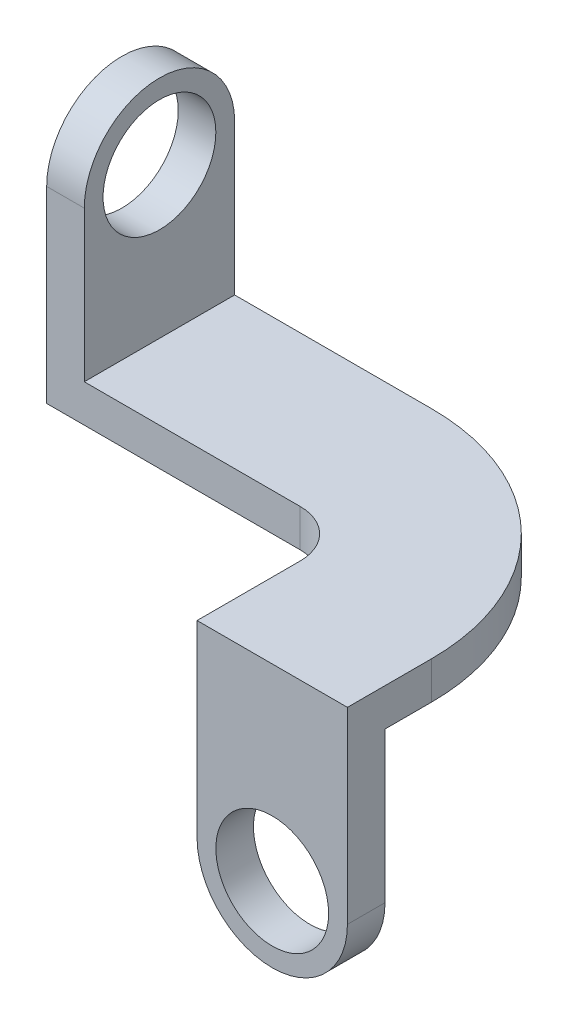
ISO-10303-21;
HEADER;
FILE_DESCRIPTION(('STEP AP214'),'2;1');
FILE_NAME('part.step','',(''),(''),'','','');
FILE_SCHEMA(('AUTOMOTIVE_DESIGN { 1 0 10303 214 1 1 1 1 }'));
ENDSEC;
DATA;
#1=APPLICATION_CONTEXT('core data for automotive mechanical design processes');
#2=APPLICATION_PROTOCOL_DEFINITION('international standard','automotive_design',2000,#1);
#3=PRODUCT_CONTEXT('',#1,'mechanical');
#4=PRODUCT('Part','Part','',(#3));
#5=PRODUCT_RELATED_PRODUCT_CATEGORY('part','',(#4));
#6=PRODUCT_DEFINITION_FORMATION('','',#4);
#7=PRODUCT_DEFINITION_CONTEXT('part definition',#1,'design');
#8=PRODUCT_DEFINITION('design','',#6,#7);
#9=PRODUCT_DEFINITION_SHAPE('','',#8);
#10=(LENGTH_UNIT() NAMED_UNIT(*) SI_UNIT(.MILLI.,.METRE.));
#11=(NAMED_UNIT(*) PLANE_ANGLE_UNIT() SI_UNIT($,.RADIAN.));
#12=(NAMED_UNIT(*) SI_UNIT($,.STERADIAN.) SOLID_ANGLE_UNIT());
#13=UNCERTAINTY_MEASURE_WITH_UNIT(LENGTH_MEASURE(1.E-05),#10,'distance_accuracy_value','');
#14=(GEOMETRIC_REPRESENTATION_CONTEXT(3) GLOBAL_UNCERTAINTY_ASSIGNED_CONTEXT((#13)) GLOBAL_UNIT_ASSIGNED_CONTEXT((#10,
#11,#12)) REPRESENTATION_CONTEXT('',''));
#15=CARTESIAN_POINT('',(0.,0.,0.));
#16=DIRECTION('',(0.,0.,1.));
#17=DIRECTION('',(1.,0.,0.));
#18=AXIS2_PLACEMENT_3D('',#15,#16,#17);
#19=CARTESIAN_POINT('',(158.496,25.4,44.704));
#20=DIRECTION('',(0.,-1.,0.));
#21=DIRECTION('',(0.,0.,-1.));
#22=AXIS2_PLACEMENT_3D('',#19,#20,#21);
#23=PLANE('',#22);
#24=DIRECTION('',(0.,0.,-1.));
#25=VECTOR('',#24,1.);
#26=CARTESIAN_POINT('',(25.4,25.4,0.));
#27=LINE('',#26,#25);
#28=CARTESIAN_POINT('',(25.4,25.4,0.));
#29=VERTEX_POINT('',#28);
#30=CARTESIAN_POINT('',(25.4,25.4,-101.6));
#31=VERTEX_POINT('',#30);
#32=EDGE_CURVE('E49',#29,#31,#27,.T.);
#33=ORIENTED_EDGE('',*,*,#32,.F.);
#34=DIRECTION('',(1.,0.,0.));
#35=VECTOR('',#34,1.);
#36=CARTESIAN_POINT('',(171.196,25.4,0.));
#37=LINE('',#36,#35);
#38=CARTESIAN_POINT('',(171.196,25.4,0.));
#39=VERTEX_POINT('',#38);
#40=EDGE_CURVE('E183',#29,#39,#37,.T.);
#41=ORIENTED_EDGE('',*,*,#40,.T.);
#42=CARTESIAN_POINT('',(171.196,25.4,32.004));
#43=DIRECTION('',(0.,-1.,0.));
#44=DIRECTION('',(0.,0.,1.));
#45=AXIS2_PLACEMENT_3D('',#42,#43,#44);
#46=CIRCLE('',#45,32.004);
#47=CARTESIAN_POINT('',(203.2,25.4,32.004));
#48=VERTEX_POINT('',#47);
#49=EDGE_CURVE('E185',#39,#48,#46,.T.);
#50=ORIENTED_EDGE('',*,*,#49,.T.);
#51=DIRECTION('',(0.,0.,1.));
#52=VECTOR('',#51,1.);
#53=CARTESIAN_POINT('',(203.2,25.4,101.6));
#54=LINE('',#53,#52);
#55=CARTESIAN_POINT('',(203.2,25.4,101.6));
#56=VERTEX_POINT('',#55);
#57=EDGE_CURVE('E193',#48,#56,#54,.T.);
#58=ORIENTED_EDGE('',*,*,#57,.T.);
#59=DIRECTION('',(1.,0.,0.));
#60=VECTOR('',#59,1.);
#61=CARTESIAN_POINT('',(304.8,25.4,101.6));
#62=LINE('',#61,#60);
#63=CARTESIAN_POINT('',(304.8,25.4,101.6));
#64=VERTEX_POINT('',#63);
#65=EDGE_CURVE('E195',#56,#64,#62,.T.);
#66=ORIENTED_EDGE('',*,*,#65,.T.);
#67=DIRECTION('',(0.,0.,-1.));
#68=VECTOR('',#67,1.);
#69=CARTESIAN_POINT('',(304.8,25.4,44.704));
#70=LINE('',#69,#68);
#71=CARTESIAN_POINT('',(304.8,25.4,44.704));
#72=VERTEX_POINT('',#71);
#73=EDGE_CURVE('E197',#64,#72,#70,.T.);
#74=ORIENTED_EDGE('',*,*,#73,.T.);
#75=CARTESIAN_POINT('',(158.496,25.4,44.704));
#76=DIRECTION('',(0.,1.,0.));
#77=DIRECTION('',(0.,0.,-1.));
#78=AXIS2_PLACEMENT_3D('',#75,#76,#77);
#79=CIRCLE('',#78,146.304);
#80=CARTESIAN_POINT('',(158.496,25.4,-101.6));
#81=VERTEX_POINT('',#80);
#82=EDGE_CURVE('E199',#72,#81,#79,.T.);
#83=ORIENTED_EDGE('',*,*,#82,.T.);
#84=DIRECTION('',(-1.,0.,0.));
#85=VECTOR('',#84,1.);
#86=CARTESIAN_POINT('',(0.,25.4,-101.6));
#87=LINE('',#86,#85);
#88=EDGE_CURVE('E163',#81,#31,#87,.T.);
#89=ORIENTED_EDGE('',*,*,#88,.T.);
#90=EDGE_LOOP('',(#33,#41,#50,#58,#66,#74,#83,#89));
#91=FACE_BOUND('',#90,.T.);
#92=ADVANCED_FACE('F32',(#91),#23,.F.);
#93=CARTESIAN_POINT('',(171.196,25.4,0.));
#94=DIRECTION('',(0.,0.,-1.));
#95=DIRECTION('',(-1.,0.,0.));
#96=AXIS2_PLACEMENT_3D('',#93,#94,#95);
#97=PLANE('',#96);
#98=DIRECTION('',(1.,0.,0.));
#99=VECTOR('',#98,1.);
#100=CARTESIAN_POINT('',(171.196,0.,0.));
#101=LINE('',#100,#99);
#102=CARTESIAN_POINT('',(0.,0.,0.));
#103=VERTEX_POINT('',#102);
#104=CARTESIAN_POINT('',(171.196,0.,0.));
#105=VERTEX_POINT('',#104);
#106=EDGE_CURVE('E202',#103,#105,#101,.T.);
#107=ORIENTED_EDGE('',*,*,#106,.T.);
#108=DIRECTION('',(0.,-1.,0.));
#109=VECTOR('',#108,1.);
#110=CARTESIAN_POINT('',(171.196,25.4,0.));
#111=LINE('',#110,#109);
#112=EDGE_CURVE('E11',#39,#105,#111,.T.);
#113=ORIENTED_EDGE('',*,*,#112,.F.);
#114=ORIENTED_EDGE('',*,*,#40,.F.);
#115=DIRECTION('',(0.,-1.,0.));
#116=VECTOR('',#115,1.);
#117=CARTESIAN_POINT('',(25.4,127.,0.));
#118=LINE('',#117,#116);
#119=CARTESIAN_POINT('',(25.4,127.,0.));
#120=VERTEX_POINT('',#119);
#121=EDGE_CURVE('E142',#120,#29,#118,.T.);
#122=ORIENTED_EDGE('',*,*,#121,.F.);
#123=DIRECTION('',(1.,0.,0.));
#124=VECTOR('',#123,1.);
#125=CARTESIAN_POINT('',(0.,127.,0.));
#126=LINE('',#125,#124);
#127=CARTESIAN_POINT('',(0.,127.,0.));
#128=VERTEX_POINT('',#127);
#129=EDGE_CURVE('E135',#128,#120,#126,.T.);
#130=ORIENTED_EDGE('',*,*,#129,.F.);
#131=DIRECTION('',(0.,-1.,0.));
#132=VECTOR('',#131,1.);
#133=CARTESIAN_POINT('',(0.,25.4,0.));
#134=LINE('',#133,#132);
#135=EDGE_CURVE('E261',#128,#103,#134,.T.);
#136=ORIENTED_EDGE('',*,*,#135,.T.);
#137=EDGE_LOOP('',(#107,#113,#114,#122,#130,#136));
#138=FACE_BOUND('',#137,.T.);
#139=ADVANCED_FACE('F34',(#138),#97,.F.);
#140=CARTESIAN_POINT('',(171.196,25.4,32.004));
#141=DIRECTION('',(0.,-1.,0.));
#142=DIRECTION('',(0.,0.,-1.));
#143=AXIS2_PLACEMENT_3D('',#140,#141,#142);
#144=CYLINDRICAL_SURFACE('',#143,32.004);
#145=CARTESIAN_POINT('',(171.196,0.,32.004));
#146=DIRECTION('',(0.,-1.,0.));
#147=DIRECTION('',(0.,0.,1.));
#148=AXIS2_PLACEMENT_3D('',#145,#146,#147);
#149=CIRCLE('',#148,32.004);
#150=CARTESIAN_POINT('',(203.2,0.,32.004));
#151=VERTEX_POINT('',#150);
#152=EDGE_CURVE('E205',#105,#151,#149,.T.);
#153=ORIENTED_EDGE('',*,*,#152,.T.);
#154=DIRECTION('',(0.,-1.,0.));
#155=VECTOR('',#154,1.);
#156=CARTESIAN_POINT('',(203.2,25.4,32.004));
#157=LINE('',#156,#155);
#158=EDGE_CURVE('E41',#48,#151,#157,.T.);
#159=ORIENTED_EDGE('',*,*,#158,.F.);
#160=ORIENTED_EDGE('',*,*,#49,.F.);
#161=ORIENTED_EDGE('',*,*,#112,.T.);
#162=EDGE_LOOP('',(#153,#159,#160,#161));
#163=FACE_BOUND('',#162,.T.);
#164=ADVANCED_FACE('F285',(#163),#144,.F.);
#165=CARTESIAN_POINT('',(203.2,25.4,101.6));
#166=DIRECTION('',(1.,0.,0.));
#167=DIRECTION('',(0.,0.,-1.));
#168=AXIS2_PLACEMENT_3D('',#165,#166,#167);
#169=PLANE('',#168);
#170=DIRECTION('',(0.,0.,1.));
#171=VECTOR('',#170,1.);
#172=CARTESIAN_POINT('',(203.2,0.,101.6));
#173=LINE('',#172,#171);
#174=CARTESIAN_POINT('',(203.2,0.,76.2));
#175=VERTEX_POINT('',#174);
#176=EDGE_CURVE('E208',#151,#175,#173,.T.);
#177=ORIENTED_EDGE('',*,*,#176,.T.);
#178=DIRECTION('',(0.,1.,0.));
#179=VECTOR('',#178,1.);
#180=CARTESIAN_POINT('',(203.2,-101.6,76.2));
#181=LINE('',#180,#179);
#182=CARTESIAN_POINT('',(203.2,-101.6,76.2));
#183=VERTEX_POINT('',#182);
#184=EDGE_CURVE('E206',#183,#175,#181,.T.);
#185=ORIENTED_EDGE('',*,*,#184,.F.);
#186=DIRECTION('',(0.,0.,-1.));
#187=VECTOR('',#186,1.);
#188=CARTESIAN_POINT('',(203.2,-101.6,101.6));
#189=LINE('',#188,#187);
#190=CARTESIAN_POINT('',(203.2,-101.6,101.6));
#191=VERTEX_POINT('',#190);
#192=EDGE_CURVE('E218',#191,#183,#189,.T.);
#193=ORIENTED_EDGE('',*,*,#192,.F.);
#194=DIRECTION('',(0.,-1.,0.));
#195=VECTOR('',#194,1.);
#196=CARTESIAN_POINT('',(203.2,25.4,101.6));
#197=LINE('',#196,#195);
#198=EDGE_CURVE('E248',#56,#191,#197,.T.);
#199=ORIENTED_EDGE('',*,*,#198,.F.);
#200=ORIENTED_EDGE('',*,*,#57,.F.);
#201=ORIENTED_EDGE('',*,*,#158,.T.);
#202=EDGE_LOOP('',(#177,#185,#193,#199,#200,#201));
#203=FACE_BOUND('',#202,.T.);
#204=ADVANCED_FACE('F231',(#203),#169,.F.);
#205=CARTESIAN_POINT('',(304.8,25.4,101.6));
#206=DIRECTION('',(0.,0.,-1.));
#207=DIRECTION('',(-1.,0.,0.));
#208=AXIS2_PLACEMENT_3D('',#205,#206,#207);
#209=PLANE('',#208);
#210=CARTESIAN_POINT('',(254.,-101.6,101.6));
#211=DIRECTION('',(0.,0.,1.));
#212=DIRECTION('',(1.,0.,0.));
#213=AXIS2_PLACEMENT_3D('',#210,#211,#212);
#214=CIRCLE('',#213,38.1);
#215=CARTESIAN_POINT('',(292.1,-101.6,101.6));
#216=VERTEX_POINT('',#215);
#217=EDGE_CURVE('E159',#216,#216,#214,.T.);
#218=ORIENTED_EDGE('',*,*,#217,.F.);
#219=EDGE_LOOP('',(#218));
#220=FACE_BOUND('',#219,.T.);
#221=ORIENTED_EDGE('',*,*,#198,.T.);
#222=CARTESIAN_POINT('',(254.,-101.6,101.6));
#223=DIRECTION('',(0.,0.,1.));
#224=DIRECTION('',(1.,0.,0.));
#225=AXIS2_PLACEMENT_3D('',#222,#223,#224);
#226=CIRCLE('',#225,50.8);
#227=CARTESIAN_POINT('',(304.8,-101.6,101.6));
#228=VERTEX_POINT('',#227);
#229=EDGE_CURVE('E173',#191,#228,#226,.T.);
#230=ORIENTED_EDGE('',*,*,#229,.T.);
#231=DIRECTION('',(0.,-1.,0.));
#232=VECTOR('',#231,1.);
#233=CARTESIAN_POINT('',(304.8,25.4,101.6));
#234=LINE('',#233,#232);
#235=EDGE_CURVE('E246',#64,#228,#234,.T.);
#236=ORIENTED_EDGE('',*,*,#235,.F.);
#237=ORIENTED_EDGE('',*,*,#65,.F.);
#238=EDGE_LOOP('',(#221,#230,#236,#237));
#239=FACE_BOUND('',#238,.T.);
#240=ADVANCED_FACE('F244',(#220,#239),#209,.F.);
#241=CARTESIAN_POINT('',(304.8,25.4,44.704));
#242=DIRECTION('',(-1.,0.,0.));
#243=DIRECTION('',(0.,0.,1.));
#244=AXIS2_PLACEMENT_3D('',#241,#242,#243);
#245=PLANE('',#244);
#246=ORIENTED_EDGE('',*,*,#235,.T.);
#247=DIRECTION('',(0.,0.,1.));
#248=VECTOR('',#247,1.);
#249=CARTESIAN_POINT('',(304.8,-101.6,101.6));
#250=LINE('',#249,#248);
#251=CARTESIAN_POINT('',(304.8,-101.6,76.2));
#252=VERTEX_POINT('',#251);
#253=EDGE_CURVE('E222',#252,#228,#250,.T.);
#254=ORIENTED_EDGE('',*,*,#253,.F.);
#255=DIRECTION('',(0.,1.,0.));
#256=VECTOR('',#255,1.);
#257=CARTESIAN_POINT('',(304.8,-101.6,76.2));
#258=LINE('',#257,#256);
#259=CARTESIAN_POINT('',(304.8,0.,76.2));
#260=VERTEX_POINT('',#259);
#261=EDGE_CURVE('E219',#252,#260,#258,.T.);
#262=ORIENTED_EDGE('',*,*,#261,.T.);
#263=DIRECTION('',(0.,0.,-1.));
#264=VECTOR('',#263,1.);
#265=CARTESIAN_POINT('',(304.8,0.,44.704));
#266=LINE('',#265,#264);
#267=CARTESIAN_POINT('',(304.8,0.,44.704));
#268=VERTEX_POINT('',#267);
#269=EDGE_CURVE('E216',#260,#268,#266,.T.);
#270=ORIENTED_EDGE('',*,*,#269,.T.);
#271=DIRECTION('',(0.,-1.,0.));
#272=VECTOR('',#271,1.);
#273=CARTESIAN_POINT('',(304.8,25.4,44.704));
#274=LINE('',#273,#272);
#275=EDGE_CURVE('E252',#72,#268,#274,.T.);
#276=ORIENTED_EDGE('',*,*,#275,.F.);
#277=ORIENTED_EDGE('',*,*,#73,.F.);
#278=EDGE_LOOP('',(#246,#254,#262,#270,#276,#277));
#279=FACE_BOUND('',#278,.T.);
#280=ADVANCED_FACE('F271',(#279),#245,.F.);
#281=CARTESIAN_POINT('',(158.496,25.4,44.704));
#282=DIRECTION('',(0.,-1.,0.));
#283=DIRECTION('',(0.,0.,-1.));
#284=AXIS2_PLACEMENT_3D('',#281,#282,#283);
#285=CYLINDRICAL_SURFACE('',#284,146.304);
#286=CARTESIAN_POINT('',(158.496,0.,44.704));
#287=DIRECTION('',(0.,1.,0.));
#288=DIRECTION('',(0.,0.,-1.));
#289=AXIS2_PLACEMENT_3D('',#286,#287,#288);
#290=CIRCLE('',#289,146.304);
#291=CARTESIAN_POINT('',(158.496,0.,-101.6));
#292=VERTEX_POINT('',#291);
#293=EDGE_CURVE('E266',#268,#292,#290,.T.);
#294=ORIENTED_EDGE('',*,*,#293,.T.);
#295=DIRECTION('',(0.,-1.,0.));
#296=VECTOR('',#295,1.);
#297=CARTESIAN_POINT('',(158.496,25.4,-101.6));
#298=LINE('',#297,#296);
#299=EDGE_CURVE('E257',#81,#292,#298,.T.);
#300=ORIENTED_EDGE('',*,*,#299,.F.);
#301=ORIENTED_EDGE('',*,*,#82,.F.);
#302=ORIENTED_EDGE('',*,*,#275,.T.);
#303=EDGE_LOOP('',(#294,#300,#301,#302));
#304=FACE_BOUND('',#303,.T.);
#305=ADVANCED_FACE('F273',(#304),#285,.T.);
#306=CARTESIAN_POINT('',(0.,25.4,-101.6));
#307=DIRECTION('',(0.,0.,1.));
#308=DIRECTION('',(1.,0.,0.));
#309=AXIS2_PLACEMENT_3D('',#306,#307,#308);
#310=PLANE('',#309);
#311=DIRECTION('',(-1.,0.,0.));
#312=VECTOR('',#311,1.);
#313=CARTESIAN_POINT('',(0.,0.,-101.6));
#314=LINE('',#313,#312);
#315=CARTESIAN_POINT('',(0.,0.,-101.6));
#316=VERTEX_POINT('',#315);
#317=EDGE_CURVE('E265',#292,#316,#314,.T.);
#318=ORIENTED_EDGE('',*,*,#317,.T.);
#319=DIRECTION('',(0.,-1.,0.));
#320=VECTOR('',#319,1.);
#321=CARTESIAN_POINT('',(0.,25.4,-101.6));
#322=LINE('',#321,#320);
#323=CARTESIAN_POINT('',(0.,127.,-101.6));
#324=VERTEX_POINT('',#323);
#325=EDGE_CURVE('E130',#324,#316,#322,.T.);
#326=ORIENTED_EDGE('',*,*,#325,.F.);
#327=DIRECTION('',(-1.,0.,0.));
#328=VECTOR('',#327,1.);
#329=CARTESIAN_POINT('',(0.,127.,-101.6));
#330=LINE('',#329,#328);
#331=CARTESIAN_POINT('',(25.4,127.,-101.6));
#332=VERTEX_POINT('',#331);
#333=EDGE_CURVE('E124',#332,#324,#330,.T.);
#334=ORIENTED_EDGE('',*,*,#333,.F.);
#335=DIRECTION('',(0.,-1.,0.));
#336=VECTOR('',#335,1.);
#337=CARTESIAN_POINT('',(25.4,127.,-101.6));
#338=LINE('',#337,#336);
#339=EDGE_CURVE('E128',#332,#31,#338,.T.);
#340=ORIENTED_EDGE('',*,*,#339,.T.);
#341=ORIENTED_EDGE('',*,*,#88,.F.);
#342=ORIENTED_EDGE('',*,*,#299,.T.);
#343=EDGE_LOOP('',(#318,#326,#334,#340,#341,#342));
#344=FACE_BOUND('',#343,.T.);
#345=ADVANCED_FACE('F126',(#344),#310,.F.);
#346=CARTESIAN_POINT('',(0.,25.4,0.));
#347=DIRECTION('',(1.,0.,0.));
#348=DIRECTION('',(0.,0.,-1.));
#349=AXIS2_PLACEMENT_3D('',#346,#347,#348);
#350=PLANE('',#349);
#351=CARTESIAN_POINT('',(0.,127.,-50.8));
#352=DIRECTION('',(1.,0.,0.));
#353=DIRECTION('',(0.,0.,-1.));
#354=AXIS2_PLACEMENT_3D('',#351,#352,#353);
#355=CIRCLE('',#354,38.1);
#356=CARTESIAN_POINT('',(0.,127.,-88.9));
#357=VERTEX_POINT('',#356);
#358=EDGE_CURVE('E148',#357,#357,#355,.T.);
#359=ORIENTED_EDGE('',*,*,#358,.T.);
#360=EDGE_LOOP('',(#359));
#361=FACE_BOUND('',#360,.T.);
#362=ORIENTED_EDGE('',*,*,#135,.F.);
#363=CARTESIAN_POINT('',(0.,127.,-50.8));
#364=DIRECTION('',(1.,0.,0.));
#365=DIRECTION('',(0.,0.,-1.));
#366=AXIS2_PLACEMENT_3D('',#363,#364,#365);
#367=CIRCLE('',#366,50.8);
#368=EDGE_CURVE('E147',#324,#128,#367,.T.);
#369=ORIENTED_EDGE('',*,*,#368,.F.);
#370=ORIENTED_EDGE('',*,*,#325,.T.);
#371=DIRECTION('',(0.,0.,1.));
#372=VECTOR('',#371,1.);
#373=CARTESIAN_POINT('',(0.,0.,0.));
#374=LINE('',#373,#372);
#375=EDGE_CURVE('E186',#316,#103,#374,.T.);
#376=ORIENTED_EDGE('',*,*,#375,.T.);
#377=EDGE_LOOP('',(#362,#369,#370,#376));
#378=FACE_BOUND('',#377,.T.);
#379=ADVANCED_FACE('F279',(#361,#378),#350,.F.);
#380=CARTESIAN_POINT('',(158.496,0.,44.704));
#381=DIRECTION('',(0.,-1.,0.));
#382=DIRECTION('',(0.,0.,-1.));
#383=AXIS2_PLACEMENT_3D('',#380,#381,#382);
#384=PLANE('',#383);
#385=DIRECTION('',(1.,0.,0.));
#386=VECTOR('',#385,1.);
#387=CARTESIAN_POINT('',(203.2,0.,76.2));
#388=LINE('',#387,#386);
#389=EDGE_CURVE('E57',#175,#260,#388,.T.);
#390=ORIENTED_EDGE('',*,*,#389,.F.);
#391=ORIENTED_EDGE('',*,*,#176,.F.);
#392=ORIENTED_EDGE('',*,*,#152,.F.);
#393=ORIENTED_EDGE('',*,*,#106,.F.);
#394=ORIENTED_EDGE('',*,*,#375,.F.);
#395=ORIENTED_EDGE('',*,*,#317,.F.);
#396=ORIENTED_EDGE('',*,*,#293,.F.);
#397=ORIENTED_EDGE('',*,*,#269,.F.);
#398=EDGE_LOOP('',(#390,#391,#392,#393,#394,#395,#396,#397));
#399=FACE_BOUND('',#398,.T.);
#400=ADVANCED_FACE('F275',(#399),#384,.T.);
#401=CARTESIAN_POINT('',(203.2,-101.6,76.2));
#402=DIRECTION('',(0.,0.,1.));
#403=DIRECTION('',(1.,0.,0.));
#404=AXIS2_PLACEMENT_3D('',#401,#402,#403);
#405=PLANE('',#404);
#406=CARTESIAN_POINT('',(254.,-101.6,76.2));
#407=DIRECTION('',(0.,0.,1.));
#408=DIRECTION('',(1.,0.,0.));
#409=AXIS2_PLACEMENT_3D('',#406,#407,#408);
#410=CIRCLE('',#409,38.1);
#411=CARTESIAN_POINT('',(292.1,-101.6,76.2));
#412=VERTEX_POINT('',#411);
#413=EDGE_CURVE('E169',#412,#412,#410,.T.);
#414=ORIENTED_EDGE('',*,*,#413,.T.);
#415=EDGE_LOOP('',(#414));
#416=FACE_BOUND('',#415,.T.);
#417=ORIENTED_EDGE('',*,*,#261,.F.);
#418=CARTESIAN_POINT('',(254.,-101.6,76.2));
#419=DIRECTION('',(0.,0.,1.));
#420=DIRECTION('',(1.,0.,0.));
#421=AXIS2_PLACEMENT_3D('',#418,#419,#420);
#422=CIRCLE('',#421,50.8);
#423=EDGE_CURVE('E178',#183,#252,#422,.T.);
#424=ORIENTED_EDGE('',*,*,#423,.F.);
#425=ORIENTED_EDGE('',*,*,#184,.T.);
#426=ORIENTED_EDGE('',*,*,#389,.T.);
#427=EDGE_LOOP('',(#417,#424,#425,#426));
#428=FACE_BOUND('',#427,.T.);
#429=ADVANCED_FACE('F227',(#416,#428),#405,.F.);
#430=CARTESIAN_POINT('',(254.,-101.6,76.2));
#431=DIRECTION('',(0.,0.,1.));
#432=DIRECTION('',(1.,0.,0.));
#433=AXIS2_PLACEMENT_3D('',#430,#431,#432);
#434=CYLINDRICAL_SURFACE('',#433,50.8);
#435=ORIENTED_EDGE('',*,*,#423,.T.);
#436=ORIENTED_EDGE('',*,*,#253,.T.);
#437=ORIENTED_EDGE('',*,*,#229,.F.);
#438=ORIENTED_EDGE('',*,*,#192,.T.);
#439=EDGE_LOOP('',(#435,#436,#437,#438));
#440=FACE_BOUND('',#439,.T.);
#441=ADVANCED_FACE('F237',(#440),#434,.T.);
#442=CARTESIAN_POINT('',(254.,-101.6,-101.6));
#443=DIRECTION('',(0.,0.,1.));
#444=DIRECTION('',(1.,0.,0.));
#445=AXIS2_PLACEMENT_3D('',#442,#443,#444);
#446=CYLINDRICAL_SURFACE('',#445,38.1);
#447=ORIENTED_EDGE('',*,*,#217,.T.);
#448=EDGE_LOOP('',(#447));
#449=FACE_BOUND('',#448,.T.);
#450=ORIENTED_EDGE('',*,*,#413,.F.);
#451=EDGE_LOOP('',(#450));
#452=FACE_BOUND('',#451,.T.);
#453=ADVANCED_FACE('F351',(#449,#452),#446,.F.);
#454=CARTESIAN_POINT('',(25.4,127.,0.));
#455=DIRECTION('',(-1.,0.,0.));
#456=DIRECTION('',(0.,0.,1.));
#457=AXIS2_PLACEMENT_3D('',#454,#455,#456);
#458=PLANE('',#457);
#459=CARTESIAN_POINT('',(25.4,127.,-50.8));
#460=DIRECTION('',(1.,0.,0.));
#461=DIRECTION('',(0.,0.,-1.));
#462=AXIS2_PLACEMENT_3D('',#459,#460,#461);
#463=CIRCLE('',#462,38.1);
#464=CARTESIAN_POINT('',(25.4,127.,-88.9));
#465=VERTEX_POINT('',#464);
#466=EDGE_CURVE('E152',#465,#465,#463,.T.);
#467=ORIENTED_EDGE('',*,*,#466,.F.);
#468=EDGE_LOOP('',(#467));
#469=FACE_BOUND('',#468,.T.);
#470=ORIENTED_EDGE('',*,*,#339,.F.);
#471=CARTESIAN_POINT('',(25.4,127.,-50.8));
#472=DIRECTION('',(1.,0.,0.));
#473=DIRECTION('',(0.,0.,-1.));
#474=AXIS2_PLACEMENT_3D('',#471,#472,#473);
#475=CIRCLE('',#474,50.8);
#476=EDGE_CURVE('E141',#332,#120,#475,.T.);
#477=ORIENTED_EDGE('',*,*,#476,.T.);
#478=ORIENTED_EDGE('',*,*,#121,.T.);
#479=ORIENTED_EDGE('',*,*,#32,.T.);
#480=EDGE_LOOP('',(#470,#477,#478,#479));
#481=FACE_BOUND('',#480,.T.);
#482=ADVANCED_FACE('F139',(#469,#481),#458,.F.);
#483=CARTESIAN_POINT('',(0.,127.,-50.8));
#484=DIRECTION('',(1.,0.,0.));
#485=DIRECTION('',(0.,0.,-1.));
#486=AXIS2_PLACEMENT_3D('',#483,#484,#485);
#487=CYLINDRICAL_SURFACE('',#486,50.8);
#488=ORIENTED_EDGE('',*,*,#333,.T.);
#489=ORIENTED_EDGE('',*,*,#368,.T.);
#490=ORIENTED_EDGE('',*,*,#129,.T.);
#491=ORIENTED_EDGE('',*,*,#476,.F.);
#492=EDGE_LOOP('',(#488,#489,#490,#491));
#493=FACE_BOUND('',#492,.T.);
#494=ADVANCED_FACE('F145',(#493),#487,.T.);
#495=CARTESIAN_POINT('',(0.,127.,-50.8));
#496=DIRECTION('',(1.,0.,0.));
#497=DIRECTION('',(0.,0.,-1.));
#498=AXIS2_PLACEMENT_3D('',#495,#496,#497);
#499=CYLINDRICAL_SURFACE('',#498,38.1);
#500=ORIENTED_EDGE('',*,*,#358,.F.);
#501=EDGE_LOOP('',(#500));
#502=FACE_BOUND('',#501,.T.);
#503=ORIENTED_EDGE('',*,*,#466,.T.);
#504=EDGE_LOOP('',(#503));
#505=FACE_BOUND('',#504,.T.);
#506=ADVANCED_FACE('F368',(#502,#505),#499,.F.);
#507=CLOSED_SHELL('',(#92,#139,#164,#204,#240,#280,#305,#345,#379,#400,#429,#441,#453,#482,#494,#506));
#508=MANIFOLD_SOLID_BREP('B2',#507);
#509=ADVANCED_BREP_SHAPE_REPRESENTATION('',(#18,#508),#14);
#510=SHAPE_DEFINITION_REPRESENTATION(#9,#509);
ENDSEC;
END-ISO-10303-21;
